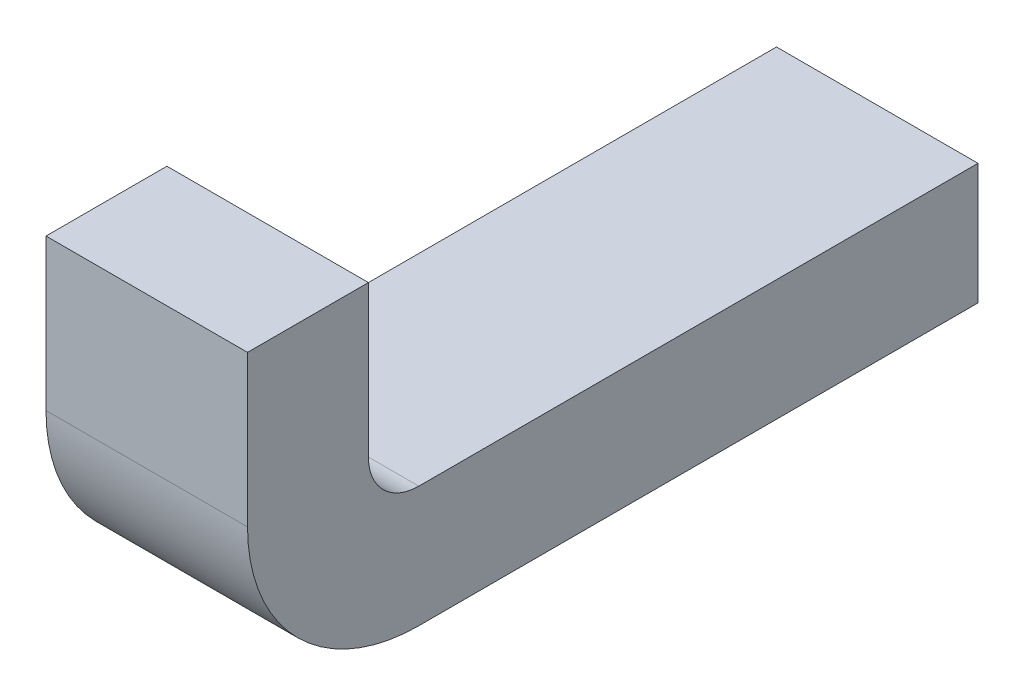
ISO-10303-21;
HEADER;
FILE_DESCRIPTION(('STEP AP214'),'2;1');
FILE_NAME('part.step','',(''),(''),'','','');
FILE_SCHEMA(('AUTOMOTIVE_DESIGN { 1 0 10303 214 1 1 1 1 }'));
ENDSEC;
DATA;
#1=APPLICATION_CONTEXT('core data for automotive mechanical design processes');
#2=APPLICATION_PROTOCOL_DEFINITION('international standard','automotive_design',2000,#1);
#3=PRODUCT_CONTEXT('',#1,'mechanical');
#4=PRODUCT('Part','Part','',(#3));
#5=PRODUCT_RELATED_PRODUCT_CATEGORY('part','',(#4));
#6=PRODUCT_DEFINITION_FORMATION('','',#4);
#7=PRODUCT_DEFINITION_CONTEXT('part definition',#1,'design');
#8=PRODUCT_DEFINITION('design','',#6,#7);
#9=PRODUCT_DEFINITION_SHAPE('','',#8);
#10=(LENGTH_UNIT() NAMED_UNIT(*) SI_UNIT(.MILLI.,.METRE.));
#11=(NAMED_UNIT(*) PLANE_ANGLE_UNIT() SI_UNIT($,.RADIAN.));
#12=(NAMED_UNIT(*) SI_UNIT($,.STERADIAN.) SOLID_ANGLE_UNIT());
#13=UNCERTAINTY_MEASURE_WITH_UNIT(LENGTH_MEASURE(1.E-05),#10,'distance_accuracy_value','');
#14=(GEOMETRIC_REPRESENTATION_CONTEXT(3) GLOBAL_UNCERTAINTY_ASSIGNED_CONTEXT((#13)) GLOBAL_UNIT_ASSIGNED_CONTEXT((#10,
#11,#12)) REPRESENTATION_CONTEXT('',''));
#15=CARTESIAN_POINT('',(0.,0.,0.));
#16=DIRECTION('',(0.,0.,1.));
#17=DIRECTION('',(1.,0.,0.));
#18=AXIS2_PLACEMENT_3D('',#15,#16,#17);
#19=CARTESIAN_POINT('',(-3.45,0.32,-3.130000000002));
#20=DIRECTION('',(0.,0.,1.));
#21=DIRECTION('',(1.,0.,0.));
#22=AXIS2_PLACEMENT_3D('',#19,#20,#21);
#23=PLANE('',#22);
#24=DIRECTION('',(0.,1.,0.));
#25=VECTOR('',#24,1.);
#26=CARTESIAN_POINT('',(-3.425,0.17,-3.130000000002));
#27=LINE('',#26,#25);
#28=CARTESIAN_POINT('',(-3.425,0.17,-3.130000000002));
#29=VERTEX_POINT('',#28);
#30=CARTESIAN_POINT('',(-3.425,0.319999999999995,-3.130000000002));
#31=VERTEX_POINT('',#30);
#32=EDGE_CURVE('E123',#29,#31,#27,.T.);
#33=ORIENTED_EDGE('',*,*,#32,.F.);
#34=DIRECTION('',(1.,0.,0.));
#35=VECTOR('',#34,1.);
#36=CARTESIAN_POINT('',(-3.45,0.17,-3.130000000002));
#37=LINE('',#36,#35);
#38=CARTESIAN_POINT('',(-3.225,0.17,-3.130000000002));
#39=VERTEX_POINT('',#38);
#40=EDGE_CURVE('E64',#39,#29,#37,.F.);
#41=ORIENTED_EDGE('',*,*,#40,.F.);
#42=DIRECTION('',(0.,-1.,0.));
#43=VECTOR('',#42,1.);
#44=CARTESIAN_POINT('',(-3.225,0.,-3.130000000002));
#45=LINE('',#44,#43);
#46=CARTESIAN_POINT('',(-3.225,0.319999999999995,-3.130000000002));
#47=VERTEX_POINT('',#46);
#48=EDGE_CURVE('E70',#39,#47,#45,.F.);
#49=ORIENTED_EDGE('',*,*,#48,.T.);
#50=DIRECTION('',(1.,0.,0.));
#51=VECTOR('',#50,1.);
#52=CARTESIAN_POINT('',(-3.45,0.319999999999985,-3.130000000002));
#53=LINE('',#52,#51);
#54=EDGE_CURVE('E160',#31,#47,#53,.T.);
#55=ORIENTED_EDGE('',*,*,#54,.F.);
#56=EDGE_LOOP('',(#33,#41,#49,#55));
#57=FACE_BOUND('',#56,.T.);
#58=ADVANCED_FACE('F16',(#57),#23,.T.);
#59=CARTESIAN_POINT('',(-3.45,0.32,-3.250000000002));
#60=DIRECTION('',(0.,1.,1.246832498358E-13));
#61=DIRECTION('',(0.,-1.246832498358E-13,1.));
#62=AXIS2_PLACEMENT_3D('',#59,#60,#61);
#63=PLANE('',#62);
#64=DIRECTION('',(0.,0.,1.));
#65=VECTOR('',#64,1.);
#66=CARTESIAN_POINT('',(-3.425,0.32,-3.300000000002));
#67=LINE('',#66,#65);
#68=CARTESIAN_POINT('',(-3.425,0.32,-3.250000000002));
#69=VERTEX_POINT('',#68);
#70=EDGE_CURVE('E101',#31,#69,#67,.F.);
#71=ORIENTED_EDGE('',*,*,#70,.F.);
#72=ORIENTED_EDGE('',*,*,#54,.T.);
#73=DIRECTION('',(0.,0.,1.));
#74=VECTOR('',#73,1.);
#75=CARTESIAN_POINT('',(-3.225,0.32,3.855));
#76=LINE('',#75,#74);
#77=CARTESIAN_POINT('',(-3.225,0.32,-3.250000000002));
#78=VERTEX_POINT('',#77);
#79=EDGE_CURVE('E148',#47,#78,#76,.F.);
#80=ORIENTED_EDGE('',*,*,#79,.T.);
#81=DIRECTION('',(-1.,0.,0.));
#82=VECTOR('',#81,1.);
#83=CARTESIAN_POINT('',(-3.45,0.32,-3.250000000002));
#84=LINE('',#83,#82);
#85=EDGE_CURVE('E155',#69,#78,#84,.F.);
#86=ORIENTED_EDGE('',*,*,#85,.F.);
#87=EDGE_LOOP('',(#71,#72,#80,#86));
#88=FACE_BOUND('',#87,.T.);
#89=ADVANCED_FACE('F179',(#88),#63,.T.);
#90=CARTESIAN_POINT('',(-3.45,0.,-3.300000000002));
#91=DIRECTION('',(0.,-1.,0.));
#92=DIRECTION('',(0.,0.,-1.));
#93=AXIS2_PLACEMENT_3D('',#90,#91,#92);
#94=PLANE('',#93);
#95=DIRECTION('',(0.,0.,1.));
#96=VECTOR('',#95,1.);
#97=CARTESIAN_POINT('',(-3.425,0.,-3.300000000002));
#98=LINE('',#97,#96);
#99=CARTESIAN_POINT('',(-3.425,0.,-3.854999999999));
#100=VERTEX_POINT('',#99);
#101=CARTESIAN_POINT('',(-3.425,0.,-3.300000000002));
#102=VERTEX_POINT('',#101);
#103=EDGE_CURVE('E112',#100,#102,#98,.T.);
#104=ORIENTED_EDGE('',*,*,#103,.F.);
#105=DIRECTION('',(-1.,0.,0.));
#106=VECTOR('',#105,1.);
#107=CARTESIAN_POINT('',(-3.45,0.,-3.854999999999));
#108=LINE('',#107,#106);
#109=CARTESIAN_POINT('',(-3.225,0.,-3.854999999999));
#110=VERTEX_POINT('',#109);
#111=EDGE_CURVE('E125',#110,#100,#108,.T.);
#112=ORIENTED_EDGE('',*,*,#111,.F.);
#113=DIRECTION('',(0.,0.,1.));
#114=VECTOR('',#113,1.);
#115=CARTESIAN_POINT('',(-3.225,0.,3.855));
#116=LINE('',#115,#114);
#117=CARTESIAN_POINT('',(-3.225,0.,-3.300000000002));
#118=VERTEX_POINT('',#117);
#119=EDGE_CURVE('E57',#110,#118,#116,.T.);
#120=ORIENTED_EDGE('',*,*,#119,.T.);
#121=DIRECTION('',(1.,0.,0.));
#122=VECTOR('',#121,1.);
#123=CARTESIAN_POINT('',(-3.45,0.,-3.300000000002));
#124=LINE('',#123,#122);
#125=EDGE_CURVE('E159',#102,#118,#124,.T.);
#126=ORIENTED_EDGE('',*,*,#125,.F.);
#127=EDGE_LOOP('',(#104,#112,#120,#126));
#128=FACE_BOUND('',#127,.T.);
#129=ADVANCED_FACE('F189',(#128),#94,.T.);
#130=CARTESIAN_POINT('',(-3.45,0.17,-3.300000000002));
#131=DIRECTION('',(1.,0.,0.));
#132=DIRECTION('',(0.,0.,-1.));
#133=AXIS2_PLACEMENT_3D('',#130,#131,#132);
#134=CYLINDRICAL_SURFACE('',#133,0.17);
#135=CARTESIAN_POINT('',(-3.425,0.17,-3.300000000002));
#136=DIRECTION('',(1.,0.,0.));
#137=DIRECTION('',(0.,0.,-1.));
#138=AXIS2_PLACEMENT_3D('',#135,#136,#137);
#139=CIRCLE('',#138,0.17);
#140=EDGE_CURVE('E95',#102,#29,#139,.F.);
#141=ORIENTED_EDGE('',*,*,#140,.F.);
#142=ORIENTED_EDGE('',*,*,#125,.T.);
#143=CARTESIAN_POINT('',(-3.225,0.17,-3.300000000002));
#144=DIRECTION('',(1.,0.,0.));
#145=DIRECTION('',(0.,0.,-1.));
#146=AXIS2_PLACEMENT_3D('',#143,#144,#145);
#147=CIRCLE('',#146,0.17);
#148=EDGE_CURVE('E19',#118,#39,#147,.F.);
#149=ORIENTED_EDGE('',*,*,#148,.T.);
#150=ORIENTED_EDGE('',*,*,#40,.T.);
#151=EDGE_LOOP('',(#141,#142,#149,#150));
#152=FACE_BOUND('',#151,.T.);
#153=ADVANCED_FACE('F192',(#152),#134,.T.);
#154=CARTESIAN_POINT('',(-3.45,0.17,-3.250000000002));
#155=DIRECTION('',(0.,0.,-1.));
#156=DIRECTION('',(-1.,0.,0.));
#157=AXIS2_PLACEMENT_3D('',#154,#155,#156);
#158=PLANE('',#157);
#159=DIRECTION('',(0.,1.,0.));
#160=VECTOR('',#159,1.);
#161=CARTESIAN_POINT('',(-3.425,0.17,-3.250000000002));
#162=LINE('',#161,#160);
#163=CARTESIAN_POINT('',(-3.425,0.17,-3.250000000002));
#164=VERTEX_POINT('',#163);
#165=EDGE_CURVE('E91',#69,#164,#162,.F.);
#166=ORIENTED_EDGE('',*,*,#165,.F.);
#167=ORIENTED_EDGE('',*,*,#85,.T.);
#168=DIRECTION('',(0.,-1.,0.));
#169=VECTOR('',#168,1.);
#170=CARTESIAN_POINT('',(-3.225,0.,-3.250000000002));
#171=LINE('',#170,#169);
#172=CARTESIAN_POINT('',(-3.225,0.17,-3.250000000002));
#173=VERTEX_POINT('',#172);
#174=EDGE_CURVE('E85',#78,#173,#171,.T.);
#175=ORIENTED_EDGE('',*,*,#174,.T.);
#176=DIRECTION('',(1.,0.,0.));
#177=VECTOR('',#176,1.);
#178=CARTESIAN_POINT('',(-3.45,0.17,-3.250000000002));
#179=LINE('',#178,#177);
#180=EDGE_CURVE('E89',#173,#164,#179,.F.);
#181=ORIENTED_EDGE('',*,*,#180,.T.);
#182=EDGE_LOOP('',(#166,#167,#175,#181));
#183=FACE_BOUND('',#182,.T.);
#184=ADVANCED_FACE('F90',(#183),#158,.T.);
#185=CARTESIAN_POINT('',(-3.225,0.,3.855));
#186=DIRECTION('',(-1.,0.,0.));
#187=DIRECTION('',(0.,-1.,0.));
#188=AXIS2_PLACEMENT_3D('',#185,#186,#187);
#189=PLANE('',#188);
#190=ORIENTED_EDGE('',*,*,#79,.F.);
#191=ORIENTED_EDGE('',*,*,#48,.F.);
#192=ORIENTED_EDGE('',*,*,#148,.F.);
#193=ORIENTED_EDGE('',*,*,#119,.F.);
#194=DIRECTION('',(0.,1.,0.));
#195=VECTOR('',#194,1.);
#196=CARTESIAN_POINT('',(-3.225,0.,-3.854999999999));
#197=LINE('',#196,#195);
#198=CARTESIAN_POINT('',(-3.225,0.12,-3.854999999999));
#199=VERTEX_POINT('',#198);
#200=EDGE_CURVE('E138',#199,#110,#197,.F.);
#201=ORIENTED_EDGE('',*,*,#200,.F.);
#202=DIRECTION('',(0.,0.,1.));
#203=VECTOR('',#202,1.);
#204=CARTESIAN_POINT('',(-3.225,0.12,-3.854999999999));
#205=LINE('',#204,#203);
#206=CARTESIAN_POINT('',(-3.225,0.12,-3.300000000002));
#207=VERTEX_POINT('',#206);
#208=EDGE_CURVE('E108',#207,#199,#205,.F.);
#209=ORIENTED_EDGE('',*,*,#208,.F.);
#210=CARTESIAN_POINT('',(-3.225,0.17,-3.300000000002));
#211=DIRECTION('',(1.,0.,0.));
#212=DIRECTION('',(0.,0.,-1.));
#213=AXIS2_PLACEMENT_3D('',#210,#211,#212);
#214=CIRCLE('',#213,0.05);
#215=EDGE_CURVE('E106',#207,#173,#214,.F.);
#216=ORIENTED_EDGE('',*,*,#215,.T.);
#217=ORIENTED_EDGE('',*,*,#174,.F.);
#218=EDGE_LOOP('',(#190,#191,#192,#193,#201,#209,#216,#217));
#219=FACE_BOUND('',#218,.T.);
#220=ADVANCED_FACE('F181',(#219),#189,.F.);
#221=CARTESIAN_POINT('',(-3.45,0.,-3.854999999999));
#222=DIRECTION('',(0.,0.,-1.));
#223=DIRECTION('',(-1.,0.,0.));
#224=AXIS2_PLACEMENT_3D('',#221,#222,#223);
#225=PLANE('',#224);
#226=DIRECTION('',(0.,1.,0.));
#227=VECTOR('',#226,1.);
#228=CARTESIAN_POINT('',(-3.425,0.17,-3.854999999999));
#229=LINE('',#228,#227);
#230=CARTESIAN_POINT('',(-3.425,0.12,-3.854999999999));
#231=VERTEX_POINT('',#230);
#232=EDGE_CURVE('E102',#231,#100,#229,.F.);
#233=ORIENTED_EDGE('',*,*,#232,.F.);
#234=DIRECTION('',(1.,0.,0.));
#235=VECTOR('',#234,1.);
#236=CARTESIAN_POINT('',(-3.45,0.12,-3.854999999999));
#237=LINE('',#236,#235);
#238=EDGE_CURVE('E129',#199,#231,#237,.F.);
#239=ORIENTED_EDGE('',*,*,#238,.F.);
#240=ORIENTED_EDGE('',*,*,#200,.T.);
#241=ORIENTED_EDGE('',*,*,#111,.T.);
#242=EDGE_LOOP('',(#233,#239,#240,#241));
#243=FACE_BOUND('',#242,.T.);
#244=ADVANCED_FACE('F188',(#243),#225,.T.);
#245=CARTESIAN_POINT('',(-3.425,0.17,-3.300000000002));
#246=DIRECTION('',(-1.,0.,0.));
#247=DIRECTION('',(0.,0.,1.));
#248=AXIS2_PLACEMENT_3D('',#245,#246,#247);
#249=PLANE('',#248);
#250=ORIENTED_EDGE('',*,*,#103,.T.);
#251=ORIENTED_EDGE('',*,*,#140,.T.);
#252=ORIENTED_EDGE('',*,*,#32,.T.);
#253=ORIENTED_EDGE('',*,*,#70,.T.);
#254=ORIENTED_EDGE('',*,*,#165,.T.);
#255=CARTESIAN_POINT('',(-3.425,0.17,-3.300000000002));
#256=DIRECTION('',(1.,0.,0.));
#257=DIRECTION('',(0.,0.,-1.));
#258=AXIS2_PLACEMENT_3D('',#255,#256,#257);
#259=CIRCLE('',#258,0.05);
#260=CARTESIAN_POINT('',(-3.425,0.12,-3.300000000002));
#261=VERTEX_POINT('',#260);
#262=EDGE_CURVE('E34',#164,#261,#259,.T.);
#263=ORIENTED_EDGE('',*,*,#262,.T.);
#264=DIRECTION('',(0.,0.,1.));
#265=VECTOR('',#264,1.);
#266=CARTESIAN_POINT('',(-3.425,0.12,-3.854999999999));
#267=LINE('',#266,#265);
#268=EDGE_CURVE('E25',#231,#261,#267,.T.);
#269=ORIENTED_EDGE('',*,*,#268,.F.);
#270=ORIENTED_EDGE('',*,*,#232,.T.);
#271=EDGE_LOOP('',(#250,#251,#252,#253,#254,#263,#269,#270));
#272=FACE_BOUND('',#271,.T.);
#273=ADVANCED_FACE('F98',(#272),#249,.T.);
#274=CARTESIAN_POINT('',(-3.45,0.17,-3.300000000002));
#275=DIRECTION('',(1.,0.,0.));
#276=DIRECTION('',(0.,0.,-1.));
#277=AXIS2_PLACEMENT_3D('',#274,#275,#276);
#278=CYLINDRICAL_SURFACE('',#277,0.05);
#279=DIRECTION('',(1.,0.,0.));
#280=VECTOR('',#279,1.);
#281=CARTESIAN_POINT('',(-3.45,0.12,-3.300000000002));
#282=LINE('',#281,#280);
#283=EDGE_CURVE('E11',#261,#207,#282,.T.);
#284=ORIENTED_EDGE('',*,*,#283,.F.);
#285=ORIENTED_EDGE('',*,*,#262,.F.);
#286=ORIENTED_EDGE('',*,*,#180,.F.);
#287=ORIENTED_EDGE('',*,*,#215,.F.);
#288=EDGE_LOOP('',(#284,#285,#286,#287));
#289=FACE_BOUND('',#288,.T.);
#290=ADVANCED_FACE('F104',(#289),#278,.F.);
#291=CARTESIAN_POINT('',(-3.45,0.12,-3.854999999999));
#292=DIRECTION('',(0.,1.,0.));
#293=DIRECTION('',(0.,0.,1.));
#294=AXIS2_PLACEMENT_3D('',#291,#292,#293);
#295=PLANE('',#294);
#296=ORIENTED_EDGE('',*,*,#268,.T.);
#297=ORIENTED_EDGE('',*,*,#283,.T.);
#298=ORIENTED_EDGE('',*,*,#208,.T.);
#299=ORIENTED_EDGE('',*,*,#238,.T.);
#300=EDGE_LOOP('',(#296,#297,#298,#299));
#301=FACE_BOUND('',#300,.T.);
#302=ADVANCED_FACE('F184',(#301),#295,.T.);
#303=CLOSED_SHELL('',(#58,#89,#129,#153,#184,#220,#244,#273,#290,#302));
#304=MANIFOLD_SOLID_BREP('B1',#303);
#305=ADVANCED_BREP_SHAPE_REPRESENTATION('',(#18,#304),#14);
#306=SHAPE_DEFINITION_REPRESENTATION(#9,#305);
ENDSEC;
END-ISO-10303-21;
